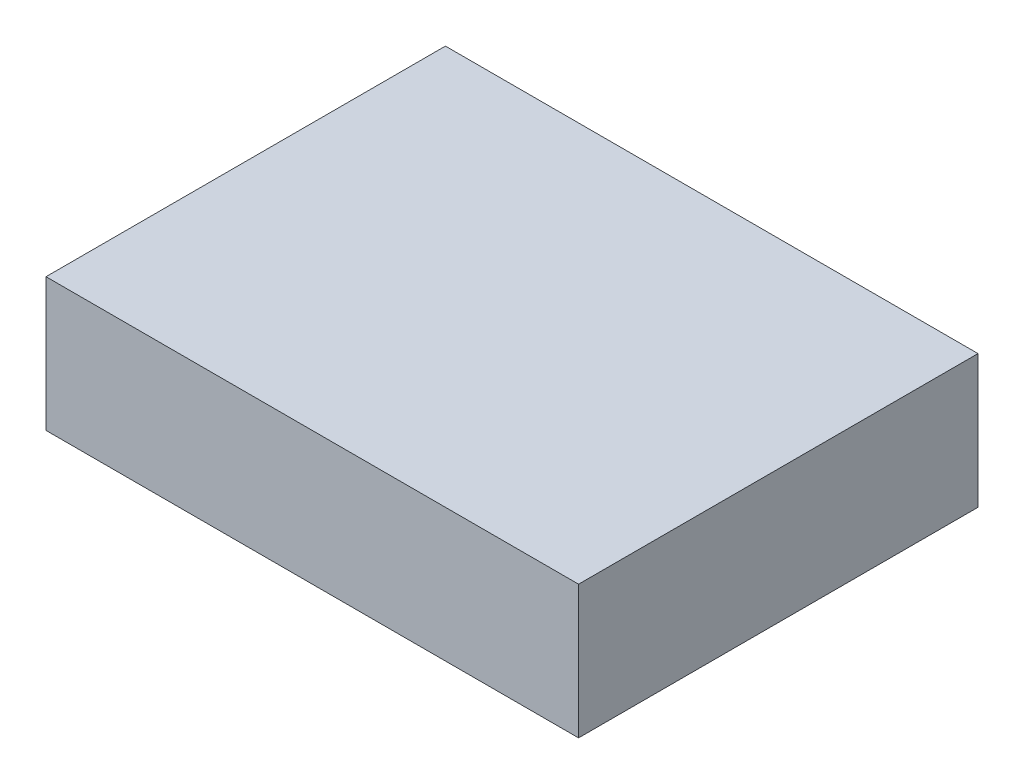
ISO-10303-21;
HEADER;
FILE_DESCRIPTION(('STEP AP214'),'2;1');
FILE_NAME('part.step','',(''),(''),'','','');
FILE_SCHEMA(('AUTOMOTIVE_DESIGN { 1 0 10303 214 1 1 1 1 }'));
ENDSEC;
DATA;
#1=APPLICATION_CONTEXT('core data for automotive mechanical design processes');
#2=APPLICATION_PROTOCOL_DEFINITION('international standard','automotive_design',2000,#1);
#3=PRODUCT_CONTEXT('',#1,'mechanical');
#4=PRODUCT('Part','Part','',(#3));
#5=PRODUCT_RELATED_PRODUCT_CATEGORY('part','',(#4));
#6=PRODUCT_DEFINITION_FORMATION('','',#4);
#7=PRODUCT_DEFINITION_CONTEXT('part definition',#1,'design');
#8=PRODUCT_DEFINITION('design','',#6,#7);
#9=PRODUCT_DEFINITION_SHAPE('','',#8);
#10=(LENGTH_UNIT() NAMED_UNIT(*) SI_UNIT(.MILLI.,.METRE.));
#11=(NAMED_UNIT(*) PLANE_ANGLE_UNIT() SI_UNIT($,.RADIAN.));
#12=(NAMED_UNIT(*) SI_UNIT($,.STERADIAN.) SOLID_ANGLE_UNIT());
#13=UNCERTAINTY_MEASURE_WITH_UNIT(LENGTH_MEASURE(1.E-05),#10,'distance_accuracy_value','');
#14=(GEOMETRIC_REPRESENTATION_CONTEXT(3) GLOBAL_UNCERTAINTY_ASSIGNED_CONTEXT((#13)) GLOBAL_UNIT_ASSIGNED_CONTEXT((#10,
#11,#12)) REPRESENTATION_CONTEXT('',''));
#15=CARTESIAN_POINT('',(0.,0.,0.));
#16=DIRECTION('',(0.,0.,1.));
#17=DIRECTION('',(1.,0.,0.));
#18=AXIS2_PLACEMENT_3D('',#15,#16,#17);
#19=CARTESIAN_POINT('',(-150.471698113208,100.,-151.415094339623));
#20=DIRECTION('',(1.,0.,0.));
#21=DIRECTION('',(0.,0.,-1.));
#22=AXIS2_PLACEMENT_3D('',#19,#20,#21);
#23=PLANE('',#22);
#24=DIRECTION('',(0.,0.,1.));
#25=VECTOR('',#24,1.);
#26=CARTESIAN_POINT('',(-150.471698113208,0.,-151.415094339623));
#27=LINE('',#26,#25);
#28=CARTESIAN_POINT('',(-150.471698113208,0.,-151.415094339623));
#29=VERTEX_POINT('',#28);
#30=CARTESIAN_POINT('',(-150.471698113207,0.,148.584905660377));
#31=VERTEX_POINT('',#30);
#32=EDGE_CURVE('E107',#29,#31,#27,.T.);
#33=ORIENTED_EDGE('',*,*,#32,.T.);
#34=DIRECTION('',(0.,-1.,0.));
#35=VECTOR('',#34,1.);
#36=CARTESIAN_POINT('',(-150.471698113207,100.,148.584905660377));
#37=LINE('',#36,#35);
#38=CARTESIAN_POINT('',(-150.471698113207,100.,148.584905660377));
#39=VERTEX_POINT('',#38);
#40=EDGE_CURVE('E11',#39,#31,#37,.T.);
#41=ORIENTED_EDGE('',*,*,#40,.F.);
#42=DIRECTION('',(0.,0.,1.));
#43=VECTOR('',#42,1.);
#44=CARTESIAN_POINT('',(-150.471698113208,100.,-151.415094339623));
#45=LINE('',#44,#43);
#46=CARTESIAN_POINT('',(-150.471698113208,100.,-151.415094339623));
#47=VERTEX_POINT('',#46);
#48=EDGE_CURVE('E91',#47,#39,#45,.T.);
#49=ORIENTED_EDGE('',*,*,#48,.F.);
#50=DIRECTION('',(0.,-1.,0.));
#51=VECTOR('',#50,1.);
#52=CARTESIAN_POINT('',(-150.471698113208,100.,-151.415094339623));
#53=LINE('',#52,#51);
#54=EDGE_CURVE('E103',#47,#29,#53,.T.);
#55=ORIENTED_EDGE('',*,*,#54,.T.);
#56=EDGE_LOOP('',(#33,#41,#49,#55));
#57=FACE_BOUND('',#56,.T.);
#58=ADVANCED_FACE('F39',(#57),#23,.F.);
#59=CARTESIAN_POINT('',(-150.471698113207,100.,148.584905660377));
#60=DIRECTION('',(0.,0.,-1.));
#61=DIRECTION('',(-1.,0.,0.));
#62=AXIS2_PLACEMENT_3D('',#59,#60,#61);
#63=PLANE('',#62);
#64=DIRECTION('',(1.,0.,0.));
#65=VECTOR('',#64,1.);
#66=CARTESIAN_POINT('',(-150.471698113207,0.,148.584905660377));
#67=LINE('',#66,#65);
#68=CARTESIAN_POINT('',(249.528301886793,0.,148.584905660377));
#69=VERTEX_POINT('',#68);
#70=EDGE_CURVE('E96',#31,#69,#67,.T.);
#71=ORIENTED_EDGE('',*,*,#70,.T.);
#72=DIRECTION('',(0.,-1.,0.));
#73=VECTOR('',#72,1.);
#74=CARTESIAN_POINT('',(249.528301886793,100.,148.584905660377));
#75=LINE('',#74,#73);
#76=CARTESIAN_POINT('',(249.528301886793,100.,148.584905660377));
#77=VERTEX_POINT('',#76);
#78=EDGE_CURVE('E48',#77,#69,#75,.T.);
#79=ORIENTED_EDGE('',*,*,#78,.F.);
#80=DIRECTION('',(1.,0.,0.));
#81=VECTOR('',#80,1.);
#82=CARTESIAN_POINT('',(-150.471698113207,100.,148.584905660377));
#83=LINE('',#82,#81);
#84=EDGE_CURVE('E86',#39,#77,#83,.T.);
#85=ORIENTED_EDGE('',*,*,#84,.F.);
#86=ORIENTED_EDGE('',*,*,#40,.T.);
#87=EDGE_LOOP('',(#71,#79,#85,#86));
#88=FACE_BOUND('',#87,.T.);
#89=ADVANCED_FACE('F95',(#88),#63,.F.);
#90=CARTESIAN_POINT('',(249.528301886792,100.,-151.415094339623));
#91=DIRECTION('',(-1.,0.,0.));
#92=DIRECTION('',(0.,0.,1.));
#93=AXIS2_PLACEMENT_3D('',#90,#91,#92);
#94=PLANE('',#93);
#95=DIRECTION('',(0.,0.,-1.));
#96=VECTOR('',#95,1.);
#97=CARTESIAN_POINT('',(249.528301886792,0.,-151.415094339623));
#98=LINE('',#97,#96);
#99=CARTESIAN_POINT('',(249.528301886792,0.,-151.415094339623));
#100=VERTEX_POINT('',#99);
#101=EDGE_CURVE('E73',#69,#100,#98,.T.);
#102=ORIENTED_EDGE('',*,*,#101,.T.);
#103=DIRECTION('',(0.,-1.,0.));
#104=VECTOR('',#103,1.);
#105=CARTESIAN_POINT('',(249.528301886792,100.,-151.415094339623));
#106=LINE('',#105,#104);
#107=CARTESIAN_POINT('',(249.528301886792,100.,-151.415094339623));
#108=VERTEX_POINT('',#107);
#109=EDGE_CURVE('E98',#108,#100,#106,.T.);
#110=ORIENTED_EDGE('',*,*,#109,.F.);
#111=DIRECTION('',(0.,0.,-1.));
#112=VECTOR('',#111,1.);
#113=CARTESIAN_POINT('',(249.528301886792,100.,-151.415094339623));
#114=LINE('',#113,#112);
#115=EDGE_CURVE('E89',#77,#108,#114,.T.);
#116=ORIENTED_EDGE('',*,*,#115,.F.);
#117=ORIENTED_EDGE('',*,*,#78,.T.);
#118=EDGE_LOOP('',(#102,#110,#116,#117));
#119=FACE_BOUND('',#118,.T.);
#120=ADVANCED_FACE('F99',(#119),#94,.F.);
#121=CARTESIAN_POINT('',(-150.471698113208,100.,-151.415094339623));
#122=DIRECTION('',(0.,0.,1.));
#123=DIRECTION('',(1.,0.,0.));
#124=AXIS2_PLACEMENT_3D('',#121,#122,#123);
#125=PLANE('',#124);
#126=DIRECTION('',(-1.,0.,0.));
#127=VECTOR('',#126,1.);
#128=CARTESIAN_POINT('',(-150.471698113208,0.,-151.415094339623));
#129=LINE('',#128,#127);
#130=EDGE_CURVE('E79',#100,#29,#129,.T.);
#131=ORIENTED_EDGE('',*,*,#130,.T.);
#132=ORIENTED_EDGE('',*,*,#54,.F.);
#133=DIRECTION('',(-1.,0.,0.));
#134=VECTOR('',#133,1.);
#135=CARTESIAN_POINT('',(-150.471698113208,100.,-151.415094339623));
#136=LINE('',#135,#134);
#137=EDGE_CURVE('E56',#108,#47,#136,.T.);
#138=ORIENTED_EDGE('',*,*,#137,.F.);
#139=ORIENTED_EDGE('',*,*,#109,.T.);
#140=EDGE_LOOP('',(#131,#132,#138,#139));
#141=FACE_BOUND('',#140,.T.);
#142=ADVANCED_FACE('F120',(#141),#125,.F.);
#143=CARTESIAN_POINT('',(0.,100.,0.));
#144=DIRECTION('',(0.,1.,0.));
#145=DIRECTION('',(0.,0.,1.));
#146=AXIS2_PLACEMENT_3D('',#143,#144,#145);
#147=PLANE('',#146);
#148=ORIENTED_EDGE('',*,*,#48,.T.);
#149=ORIENTED_EDGE('',*,*,#84,.T.);
#150=ORIENTED_EDGE('',*,*,#115,.T.);
#151=ORIENTED_EDGE('',*,*,#137,.T.);
#152=EDGE_LOOP('',(#148,#149,#150,#151));
#153=FACE_BOUND('',#152,.T.);
#154=ADVANCED_FACE('F87',(#153),#147,.T.);
#155=CARTESIAN_POINT('',(0.,0.,0.));
#156=DIRECTION('',(0.,1.,0.));
#157=DIRECTION('',(0.,0.,1.));
#158=AXIS2_PLACEMENT_3D('',#155,#156,#157);
#159=PLANE('',#158);
#160=ORIENTED_EDGE('',*,*,#32,.F.);
#161=ORIENTED_EDGE('',*,*,#130,.F.);
#162=ORIENTED_EDGE('',*,*,#101,.F.);
#163=ORIENTED_EDGE('',*,*,#70,.F.);
#164=EDGE_LOOP('',(#160,#161,#162,#163));
#165=FACE_BOUND('',#164,.T.);
#166=ADVANCED_FACE('F123',(#165),#159,.F.);
#167=CLOSED_SHELL('',(#58,#89,#120,#142,#154,#166));
#168=MANIFOLD_SOLID_BREP('B2',#167);
#169=ADVANCED_BREP_SHAPE_REPRESENTATION('',(#18,#168),#14);
#170=SHAPE_DEFINITION_REPRESENTATION(#9,#169);
ENDSEC;
END-ISO-10303-21;
